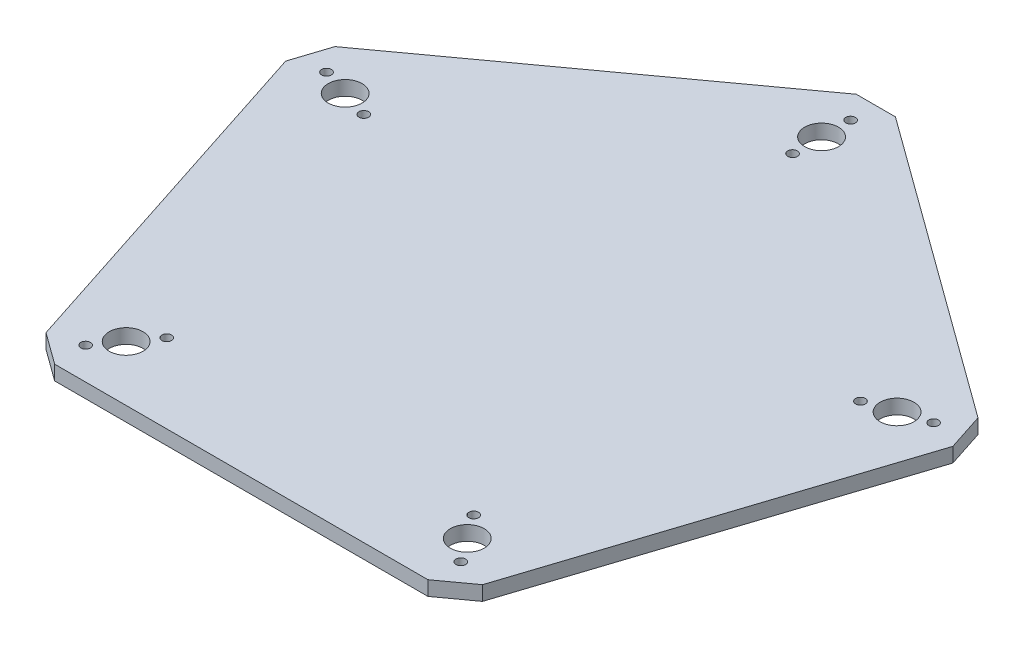
ISO-10303-21;
HEADER;
FILE_DESCRIPTION(('STEP AP214'),'2;1');
FILE_NAME('part.step','',(''),(''),'','','');
FILE_SCHEMA(('AUTOMOTIVE_DESIGN { 1 0 10303 214 1 1 1 1 }'));
ENDSEC;
DATA;
#1=APPLICATION_CONTEXT('core data for automotive mechanical design processes');
#2=APPLICATION_PROTOCOL_DEFINITION('international standard','automotive_design',2000,#1);
#3=PRODUCT_CONTEXT('',#1,'mechanical');
#4=PRODUCT('Part','Part','',(#3));
#5=PRODUCT_RELATED_PRODUCT_CATEGORY('part','',(#4));
#6=PRODUCT_DEFINITION_FORMATION('','',#4);
#7=PRODUCT_DEFINITION_CONTEXT('part definition',#1,'design');
#8=PRODUCT_DEFINITION('design','',#6,#7);
#9=PRODUCT_DEFINITION_SHAPE('','',#8);
#10=(LENGTH_UNIT() NAMED_UNIT(*) SI_UNIT(.MILLI.,.METRE.));
#11=(NAMED_UNIT(*) PLANE_ANGLE_UNIT() SI_UNIT($,.RADIAN.));
#12=(NAMED_UNIT(*) SI_UNIT($,.STERADIAN.) SOLID_ANGLE_UNIT());
#13=UNCERTAINTY_MEASURE_WITH_UNIT(LENGTH_MEASURE(1.E-05),#10,'distance_accuracy_value','');
#14=(GEOMETRIC_REPRESENTATION_CONTEXT(3) GLOBAL_UNCERTAINTY_ASSIGNED_CONTEXT((#13)) GLOBAL_UNIT_ASSIGNED_CONTEXT((#10,
#11,#12)) REPRESENTATION_CONTEXT('',''));
#15=CARTESIAN_POINT('',(0.,0.,0.));
#16=DIRECTION('',(0.,0.,1.));
#17=DIRECTION('',(1.,0.,0.));
#18=AXIS2_PLACEMENT_3D('',#15,#16,#17);
#19=CARTESIAN_POINT('',(0.,3.,0.));
#20=DIRECTION('',(0.,1.,0.));
#21=DIRECTION('',(0.,0.,1.));
#22=AXIS2_PLACEMENT_3D('',#19,#20,#21);
#23=PLANE('',#22);
#24=CARTESIAN_POINT('',(-38.7938266513032,3.,53.3951216287465));
#25=DIRECTION('',(0.,1.,0.));
#26=DIRECTION('',(0.,0.,1.));
#27=AXIS2_PLACEMENT_3D('',#24,#25,#26);
#28=CIRCLE('',#27,0.999999999999983);
#29=CARTESIAN_POINT('',(-38.7938266513032,3.,54.3951216287465));
#30=VERTEX_POINT('',#29);
#31=EDGE_CURVE('E275',#30,#30,#28,.T.);
#32=ORIENTED_EDGE('',*,*,#31,.F.);
#33=EDGE_LOOP('',(#32));
#34=FACE_BOUND('',#33,.T.);
#35=CARTESIAN_POINT('',(38.7938266513032,3.,53.3951216287465));
#36=DIRECTION('',(0.,1.,0.));
#37=DIRECTION('',(0.,0.,1.));
#38=AXIS2_PLACEMENT_3D('',#35,#36,#37);
#39=CIRCLE('',#38,0.999999999999998);
#40=CARTESIAN_POINT('',(38.7938266513032,3.,54.3951216287465));
#41=VERTEX_POINT('',#40);
#42=EDGE_CURVE('E263',#41,#41,#39,.T.);
#43=ORIENTED_EDGE('',*,*,#42,.F.);
#44=EDGE_LOOP('',(#43));
#45=FACE_BOUND('',#44,.T.);
#46=CARTESIAN_POINT('',(62.7697300754801,3.,-20.3951216287466));
#47=DIRECTION('',(0.,1.,0.));
#48=DIRECTION('',(0.,0.,1.));
#49=AXIS2_PLACEMENT_3D('',#46,#47,#48);
#50=CIRCLE('',#49,0.999999999999984);
#51=CARTESIAN_POINT('',(62.7697300754801,3.,-19.3951216287466));
#52=VERTEX_POINT('',#51);
#53=EDGE_CURVE('E251',#52,#52,#50,.T.);
#54=ORIENTED_EDGE('',*,*,#53,.F.);
#55=EDGE_LOOP('',(#54));
#56=FACE_BOUND('',#55,.T.);
#57=CARTESIAN_POINT('',(0.,3.,-66.));
#58=DIRECTION('',(0.,1.,0.));
#59=DIRECTION('',(0.,0.,1.));
#60=AXIS2_PLACEMENT_3D('',#57,#58,#59);
#61=CIRCLE('',#60,0.999999999999996);
#62=CARTESIAN_POINT('',(0.,3.,-65.));
#63=VERTEX_POINT('',#62);
#64=EDGE_CURVE('E239',#63,#63,#61,.T.);
#65=ORIENTED_EDGE('',*,*,#64,.F.);
#66=EDGE_LOOP('',(#65));
#67=FACE_BOUND('',#66,.T.);
#68=CARTESIAN_POINT('',(-35.2671151375483,3.,48.5410196624969));
#69=DIRECTION('',(0.,1.,0.));
#70=DIRECTION('',(0.,0.,1.));
#71=AXIS2_PLACEMENT_3D('',#68,#69,#70);
#72=CIRCLE('',#71,3.5);
#73=CARTESIAN_POINT('',(-35.2671151375483,3.,52.0410196624969));
#74=VERTEX_POINT('',#73);
#75=EDGE_CURVE('E227',#74,#74,#72,.T.);
#76=ORIENTED_EDGE('',*,*,#75,.F.);
#77=EDGE_LOOP('',(#76));
#78=FACE_BOUND('',#77,.T.);
#79=CARTESIAN_POINT('',(57.0633909777092,3.,-18.5410196624969));
#80=DIRECTION('',(0.,1.,0.));
#81=DIRECTION('',(0.,0.,1.));
#82=AXIS2_PLACEMENT_3D('',#79,#80,#81);
#83=CIRCLE('',#82,3.5);
#84=CARTESIAN_POINT('',(57.0633909777092,3.,-15.0410196624969));
#85=VERTEX_POINT('',#84);
#86=EDGE_CURVE('E215',#85,#85,#83,.T.);
#87=ORIENTED_EDGE('',*,*,#86,.F.);
#88=EDGE_LOOP('',(#87));
#89=FACE_BOUND('',#88,.T.);
#90=CARTESIAN_POINT('',(-62.7697300754801,3.,-20.3951216287465));
#91=DIRECTION('',(0.,1.,0.));
#92=DIRECTION('',(0.,0.,1.));
#93=AXIS2_PLACEMENT_3D('',#90,#91,#92);
#94=CIRCLE('',#93,0.999999999999998);
#95=CARTESIAN_POINT('',(-62.7697300754801,3.,-19.3951216287465));
#96=VERTEX_POINT('',#95);
#97=EDGE_CURVE('E203',#96,#96,#94,.T.);
#98=ORIENTED_EDGE('',*,*,#97,.F.);
#99=EDGE_LOOP('',(#98));
#100=FACE_BOUND('',#99,.T.);
#101=DIRECTION('',(0.309016994374948,0.,0.951056516295154));
#102=VECTOR('',#101,1.);
#103=CARTESIAN_POINT('',(-70.5342302750968,3.,-22.9179606750063));
#104=LINE('',#103,#102);
#105=CARTESIAN_POINT('',(-68.989145303222,3.,-18.1626780935305));
#106=VERTEX_POINT('',#105);
#107=CARTESIAN_POINT('',(-45.1376366521964,3.,55.2447174185242));
#108=VERTEX_POINT('',#107);
#109=EDGE_CURVE('E194',#106,#108,#104,.T.);
#110=ORIENTED_EDGE('',*,*,#109,.T.);
#111=DIRECTION('',(-0.809016994374947,0.,-0.587785252292474));
#112=VECTOR('',#111,1.);
#113=CARTESIAN_POINT('',(-41.8650941662591,3.,57.6223587092621));
#114=LINE('',#113,#112);
#115=CARTESIAN_POINT('',(-38.5925516803216,3.,60.));
#116=VERTEX_POINT('',#115);
#117=EDGE_CURVE('E165',#108,#116,#114,.F.);
#118=ORIENTED_EDGE('',*,*,#117,.T.);
#119=DIRECTION('',(1.,0.,0.));
#120=VECTOR('',#119,1.);
#121=CARTESIAN_POINT('',(-43.5925516803217,3.,60.));
#122=LINE('',#121,#120);
#123=CARTESIAN_POINT('',(38.5925516803215,3.,60.));
#124=VERTEX_POINT('',#123);
#125=EDGE_CURVE('E131',#116,#124,#122,.T.);
#126=ORIENTED_EDGE('',*,*,#125,.T.);
#127=DIRECTION('',(-0.809016994374948,0.,0.587785252292473));
#128=VECTOR('',#127,1.);
#129=CARTESIAN_POINT('',(41.865094166259,3.,57.6223587092621));
#130=LINE('',#129,#128);
#131=CARTESIAN_POINT('',(45.1376366521964,3.,55.2447174185242));
#132=VERTEX_POINT('',#131);
#133=EDGE_CURVE('E163',#124,#132,#130,.F.);
#134=ORIENTED_EDGE('',*,*,#133,.T.);
#135=DIRECTION('',(0.309016994374947,0.,-0.951056516295154));
#136=VECTOR('',#135,1.);
#137=CARTESIAN_POINT('',(43.5925516803216,3.,60.));
#138=LINE('',#137,#136);
#139=CARTESIAN_POINT('',(68.989145303222,3.,-18.1626780935305));
#140=VERTEX_POINT('',#139);
#141=EDGE_CURVE('E138',#132,#140,#138,.T.);
#142=ORIENTED_EDGE('',*,*,#141,.T.);
#143=DIRECTION('',(0.309016994374947,0.,0.951056516295154));
#144=VECTOR('',#143,1.);
#145=CARTESIAN_POINT('',(67.739145303222,3.,-22.0097825149995));
#146=LINE('',#145,#144);
#147=CARTESIAN_POINT('',(66.489145303222,3.,-25.8568869364687));
#148=VERTEX_POINT('',#147);
#149=EDGE_CURVE('E161',#140,#148,#146,.F.);
#150=ORIENTED_EDGE('',*,*,#149,.T.);
#151=DIRECTION('',(-0.809016994374947,0.,-0.587785252292473));
#152=VECTOR('',#151,1.);
#153=CARTESIAN_POINT('',(70.5342302750968,3.,-22.9179606750063));
#154=LINE('',#153,#152);
#155=CARTESIAN_POINT('',(4.04508497187477,3.,-71.225152388525));
#156=VERTEX_POINT('',#155);
#157=EDGE_CURVE('E142',#148,#156,#154,.T.);
#158=ORIENTED_EDGE('',*,*,#157,.T.);
#159=DIRECTION('',(1.,0.,0.));
#160=VECTOR('',#159,1.);
#161=CARTESIAN_POINT('',(1.22178836575723E-13,3.,-71.225152388525));
#162=LINE('',#161,#160);
#163=CARTESIAN_POINT('',(-4.04508497187471,3.,-71.225152388525));
#164=VERTEX_POINT('',#163);
#165=EDGE_CURVE('E54',#156,#164,#162,.F.);
#166=ORIENTED_EDGE('',*,*,#165,.T.);
#167=DIRECTION('',(-0.809016994374947,0.,0.587785252292473));
#168=VECTOR('',#167,1.);
#169=CARTESIAN_POINT('',(0.,3.,-74.1640786499874));
#170=LINE('',#169,#168);
#171=CARTESIAN_POINT('',(-66.489145303222,3.,-25.8568869364687));
#172=VERTEX_POINT('',#171);
#173=EDGE_CURVE('E197',#164,#172,#170,.T.);
#174=ORIENTED_EDGE('',*,*,#173,.T.);
#175=DIRECTION('',(0.309016994374948,0.,-0.951056516295154));
#176=VECTOR('',#175,1.);
#177=CARTESIAN_POINT('',(-67.739145303222,3.,-22.0097825149996));
#178=LINE('',#177,#176);
#179=EDGE_CURVE('E158',#172,#106,#178,.F.);
#180=ORIENTED_EDGE('',*,*,#179,.T.);
#181=EDGE_LOOP('',(#110,#118,#126,#134,#142,#150,#158,#166,#174,#180));
#182=FACE_BOUND('',#181,.T.);
#183=CARTESIAN_POINT('',(-57.0633909777092,3.,-18.5410196624968));
#184=DIRECTION('',(0.,1.,0.));
#185=DIRECTION('',(0.,0.,1.));
#186=AXIS2_PLACEMENT_3D('',#183,#184,#185);
#187=CIRCLE('',#186,3.5);
#188=CARTESIAN_POINT('',(-57.0633909777092,3.,-15.0410196624968));
#189=VERTEX_POINT('',#188);
#190=EDGE_CURVE('E190',#189,#189,#187,.T.);
#191=ORIENTED_EDGE('',*,*,#190,.F.);
#192=EDGE_LOOP('',(#191));
#193=FACE_BOUND('',#192,.T.);
#194=CARTESIAN_POINT('',(0.,3.,-60.));
#195=DIRECTION('',(0.,1.,0.));
#196=DIRECTION('',(0.,0.,1.));
#197=AXIS2_PLACEMENT_3D('',#194,#195,#196);
#198=CIRCLE('',#197,3.5);
#199=CARTESIAN_POINT('',(0.,3.,-56.5));
#200=VERTEX_POINT('',#199);
#201=EDGE_CURVE('E209',#200,#200,#198,.T.);
#202=ORIENTED_EDGE('',*,*,#201,.F.);
#203=EDGE_LOOP('',(#202));
#204=FACE_BOUND('',#203,.T.);
#205=CARTESIAN_POINT('',(35.2671151375484,3.,48.5410196624968));
#206=DIRECTION('',(0.,1.,0.));
#207=DIRECTION('',(0.,0.,1.));
#208=AXIS2_PLACEMENT_3D('',#205,#206,#207);
#209=CIRCLE('',#208,3.5);
#210=CARTESIAN_POINT('',(35.2671151375484,3.,52.0410196624968));
#211=VERTEX_POINT('',#210);
#212=EDGE_CURVE('E221',#211,#211,#209,.T.);
#213=ORIENTED_EDGE('',*,*,#212,.F.);
#214=EDGE_LOOP('',(#213));
#215=FACE_BOUND('',#214,.T.);
#216=CARTESIAN_POINT('',(-51.3570518799383,3.,-16.6869176962471));
#217=DIRECTION('',(0.,1.,0.));
#218=DIRECTION('',(0.,0.,-1.));
#219=AXIS2_PLACEMENT_3D('',#216,#217,#218);
#220=CIRCLE('',#219,0.999999999999998);
#221=CARTESIAN_POINT('',(-51.3570518799383,3.,-17.6869176962471));
#222=VERTEX_POINT('',#221);
#223=EDGE_CURVE('E233',#222,#222,#220,.T.);
#224=ORIENTED_EDGE('',*,*,#223,.F.);
#225=EDGE_LOOP('',(#224));
#226=FACE_BOUND('',#225,.T.);
#227=CARTESIAN_POINT('',(0.,3.,-54.));
#228=DIRECTION('',(0.,1.,0.));
#229=DIRECTION('',(0.,0.,-1.));
#230=AXIS2_PLACEMENT_3D('',#227,#228,#229);
#231=CIRCLE('',#230,1.);
#232=CARTESIAN_POINT('',(0.,3.,-55.));
#233=VERTEX_POINT('',#232);
#234=EDGE_CURVE('E245',#233,#233,#231,.T.);
#235=ORIENTED_EDGE('',*,*,#234,.F.);
#236=EDGE_LOOP('',(#235));
#237=FACE_BOUND('',#236,.T.);
#238=CARTESIAN_POINT('',(51.3570518799382,3.,-16.6869176962472));
#239=DIRECTION('',(0.,1.,0.));
#240=DIRECTION('',(0.,0.,-1.));
#241=AXIS2_PLACEMENT_3D('',#238,#239,#240);
#242=CIRCLE('',#241,0.999999999999998);
#243=CARTESIAN_POINT('',(51.3570518799382,3.,-17.6869176962472));
#244=VERTEX_POINT('',#243);
#245=EDGE_CURVE('E257',#244,#244,#242,.T.);
#246=ORIENTED_EDGE('',*,*,#245,.F.);
#247=EDGE_LOOP('',(#246));
#248=FACE_BOUND('',#247,.T.);
#249=CARTESIAN_POINT('',(31.7404036237935,3.,43.6869176962471));
#250=DIRECTION('',(0.,1.,0.));
#251=DIRECTION('',(0.,0.,-1.));
#252=AXIS2_PLACEMENT_3D('',#249,#250,#251);
#253=CIRCLE('',#252,0.999999999999998);
#254=CARTESIAN_POINT('',(31.7404036237935,3.,42.6869176962471));
#255=VERTEX_POINT('',#254);
#256=EDGE_CURVE('E269',#255,#255,#253,.T.);
#257=ORIENTED_EDGE('',*,*,#256,.F.);
#258=EDGE_LOOP('',(#257));
#259=FACE_BOUND('',#258,.T.);
#260=CARTESIAN_POINT('',(-31.7404036237935,3.,43.6869176962471));
#261=DIRECTION('',(0.,1.,0.));
#262=DIRECTION('',(0.,0.,-1.));
#263=AXIS2_PLACEMENT_3D('',#260,#261,#262);
#264=CIRCLE('',#263,0.999999999999998);
#265=CARTESIAN_POINT('',(-31.7404036237935,3.,42.6869176962471));
#266=VERTEX_POINT('',#265);
#267=EDGE_CURVE('E281',#266,#266,#264,.T.);
#268=ORIENTED_EDGE('',*,*,#267,.F.);
#269=EDGE_LOOP('',(#268));
#270=FACE_BOUND('',#269,.T.);
#271=ADVANCED_FACE('F33',(#34,#45,#56,#67,#78,#89,#100,#182,#193,#204,#215,#226,#237,#248,#259,
#270),#23,.T.);
#272=CARTESIAN_POINT('',(0.,0.,0.));
#273=DIRECTION('',(0.,1.,0.));
#274=DIRECTION('',(0.,0.,1.));
#275=AXIS2_PLACEMENT_3D('',#272,#273,#274);
#276=PLANE('',#275);
#277=CARTESIAN_POINT('',(-38.7938266513032,0.,53.3951216287465));
#278=DIRECTION('',(0.,1.,0.));
#279=DIRECTION('',(0.,0.,1.));
#280=AXIS2_PLACEMENT_3D('',#277,#278,#279);
#281=CIRCLE('',#280,0.999999999999983);
#282=CARTESIAN_POINT('',(-38.7938266513032,0.,54.3951216287465));
#283=VERTEX_POINT('',#282);
#284=EDGE_CURVE('E278',#283,#283,#281,.T.);
#285=ORIENTED_EDGE('',*,*,#284,.T.);
#286=EDGE_LOOP('',(#285));
#287=FACE_BOUND('',#286,.T.);
#288=CARTESIAN_POINT('',(38.7938266513032,0.,53.3951216287465));
#289=DIRECTION('',(0.,1.,0.));
#290=DIRECTION('',(0.,0.,1.));
#291=AXIS2_PLACEMENT_3D('',#288,#289,#290);
#292=CIRCLE('',#291,0.999999999999998);
#293=CARTESIAN_POINT('',(38.7938266513032,0.,54.3951216287465));
#294=VERTEX_POINT('',#293);
#295=EDGE_CURVE('E266',#294,#294,#292,.T.);
#296=ORIENTED_EDGE('',*,*,#295,.T.);
#297=EDGE_LOOP('',(#296));
#298=FACE_BOUND('',#297,.T.);
#299=CARTESIAN_POINT('',(62.7697300754801,0.,-20.3951216287466));
#300=DIRECTION('',(0.,1.,0.));
#301=DIRECTION('',(0.,0.,1.));
#302=AXIS2_PLACEMENT_3D('',#299,#300,#301);
#303=CIRCLE('',#302,0.999999999999984);
#304=CARTESIAN_POINT('',(62.7697300754801,0.,-19.3951216287466));
#305=VERTEX_POINT('',#304);
#306=EDGE_CURVE('E254',#305,#305,#303,.T.);
#307=ORIENTED_EDGE('',*,*,#306,.T.);
#308=EDGE_LOOP('',(#307));
#309=FACE_BOUND('',#308,.T.);
#310=CARTESIAN_POINT('',(0.,0.,-66.));
#311=DIRECTION('',(0.,1.,0.));
#312=DIRECTION('',(0.,0.,1.));
#313=AXIS2_PLACEMENT_3D('',#310,#311,#312);
#314=CIRCLE('',#313,0.999999999999996);
#315=CARTESIAN_POINT('',(0.,0.,-65.));
#316=VERTEX_POINT('',#315);
#317=EDGE_CURVE('E242',#316,#316,#314,.T.);
#318=ORIENTED_EDGE('',*,*,#317,.T.);
#319=EDGE_LOOP('',(#318));
#320=FACE_BOUND('',#319,.T.);
#321=CARTESIAN_POINT('',(-35.2671151375483,0.,48.5410196624969));
#322=DIRECTION('',(0.,1.,0.));
#323=DIRECTION('',(0.,0.,1.));
#324=AXIS2_PLACEMENT_3D('',#321,#322,#323);
#325=CIRCLE('',#324,3.5);
#326=CARTESIAN_POINT('',(-35.2671151375483,0.,52.0410196624969));
#327=VERTEX_POINT('',#326);
#328=EDGE_CURVE('E230',#327,#327,#325,.T.);
#329=ORIENTED_EDGE('',*,*,#328,.T.);
#330=EDGE_LOOP('',(#329));
#331=FACE_BOUND('',#330,.T.);
#332=CARTESIAN_POINT('',(57.0633909777092,0.,-18.5410196624969));
#333=DIRECTION('',(0.,1.,0.));
#334=DIRECTION('',(0.,0.,1.));
#335=AXIS2_PLACEMENT_3D('',#332,#333,#334);
#336=CIRCLE('',#335,3.5);
#337=CARTESIAN_POINT('',(57.0633909777092,0.,-15.0410196624969));
#338=VERTEX_POINT('',#337);
#339=EDGE_CURVE('E218',#338,#338,#336,.T.);
#340=ORIENTED_EDGE('',*,*,#339,.T.);
#341=EDGE_LOOP('',(#340));
#342=FACE_BOUND('',#341,.T.);
#343=CARTESIAN_POINT('',(-62.7697300754801,0.,-20.3951216287465));
#344=DIRECTION('',(0.,1.,0.));
#345=DIRECTION('',(0.,0.,1.));
#346=AXIS2_PLACEMENT_3D('',#343,#344,#345);
#347=CIRCLE('',#346,0.999999999999998);
#348=CARTESIAN_POINT('',(-62.7697300754801,0.,-19.3951216287465));
#349=VERTEX_POINT('',#348);
#350=EDGE_CURVE('E206',#349,#349,#347,.T.);
#351=ORIENTED_EDGE('',*,*,#350,.T.);
#352=EDGE_LOOP('',(#351));
#353=FACE_BOUND('',#352,.T.);
#354=DIRECTION('',(1.,0.,0.));
#355=VECTOR('',#354,1.);
#356=CARTESIAN_POINT('',(-43.5925516803217,0.,60.));
#357=LINE('',#356,#355);
#358=CARTESIAN_POINT('',(-38.5925516803216,0.,60.));
#359=VERTEX_POINT('',#358);
#360=CARTESIAN_POINT('',(38.5925516803216,0.,60.));
#361=VERTEX_POINT('',#360);
#362=EDGE_CURVE('E128',#359,#361,#357,.T.);
#363=ORIENTED_EDGE('',*,*,#362,.F.);
#364=DIRECTION('',(0.809016994374947,0.,0.587785252292474));
#365=VECTOR('',#364,1.);
#366=CARTESIAN_POINT('',(-38.5925516803216,0.,60.));
#367=LINE('',#366,#365);
#368=CARTESIAN_POINT('',(-45.1376366521964,0.,55.2447174185242));
#369=VERTEX_POINT('',#368);
#370=EDGE_CURVE('E111',#359,#369,#367,.F.);
#371=ORIENTED_EDGE('',*,*,#370,.T.);
#372=DIRECTION('',(0.309016994374948,0.,0.951056516295154));
#373=VECTOR('',#372,1.);
#374=CARTESIAN_POINT('',(-70.5342302750968,0.,-22.9179606750063));
#375=LINE('',#374,#373);
#376=CARTESIAN_POINT('',(-68.989145303222,0.,-18.1626780935305));
#377=VERTEX_POINT('',#376);
#378=EDGE_CURVE('E139',#377,#369,#375,.T.);
#379=ORIENTED_EDGE('',*,*,#378,.F.);
#380=DIRECTION('',(-0.309016994374948,0.,0.951056516295154));
#381=VECTOR('',#380,1.);
#382=CARTESIAN_POINT('',(-68.989145303222,0.,-18.1626780935305));
#383=LINE('',#382,#381);
#384=CARTESIAN_POINT('',(-66.489145303222,0.,-25.8568869364687));
#385=VERTEX_POINT('',#384);
#386=EDGE_CURVE('E132',#377,#385,#383,.F.);
#387=ORIENTED_EDGE('',*,*,#386,.T.);
#388=DIRECTION('',(-0.809016994374947,0.,0.587785252292473));
#389=VECTOR('',#388,1.);
#390=CARTESIAN_POINT('',(0.,0.,-74.1640786499874));
#391=LINE('',#390,#389);
#392=CARTESIAN_POINT('',(-4.04508497187472,0.,-71.225152388525));
#393=VERTEX_POINT('',#392);
#394=EDGE_CURVE('E144',#393,#385,#391,.T.);
#395=ORIENTED_EDGE('',*,*,#394,.F.);
#396=DIRECTION('',(-1.,0.,0.));
#397=VECTOR('',#396,1.);
#398=CARTESIAN_POINT('',(-4.04508497187473,0.,-71.225152388525));
#399=LINE('',#398,#397);
#400=CARTESIAN_POINT('',(4.04508497187478,0.,-71.225152388525));
#401=VERTEX_POINT('',#400);
#402=EDGE_CURVE('E150',#393,#401,#399,.F.);
#403=ORIENTED_EDGE('',*,*,#402,.T.);
#404=DIRECTION('',(-0.809016994374947,0.,-0.587785252292473));
#405=VECTOR('',#404,1.);
#406=CARTESIAN_POINT('',(70.5342302750968,0.,-22.9179606750063));
#407=LINE('',#406,#405);
#408=CARTESIAN_POINT('',(66.489145303222,0.,-25.8568869364687));
#409=VERTEX_POINT('',#408);
#410=EDGE_CURVE('E182',#409,#401,#407,.T.);
#411=ORIENTED_EDGE('',*,*,#410,.F.);
#412=DIRECTION('',(-0.309016994374947,0.,-0.951056516295154));
#413=VECTOR('',#412,1.);
#414=CARTESIAN_POINT('',(66.489145303222,0.,-25.8568869364687));
#415=LINE('',#414,#413);
#416=CARTESIAN_POINT('',(68.989145303222,0.,-18.1626780935305));
#417=VERTEX_POINT('',#416);
#418=EDGE_CURVE('E152',#409,#417,#415,.F.);
#419=ORIENTED_EDGE('',*,*,#418,.T.);
#420=DIRECTION('',(0.309016994374947,0.,-0.951056516295154));
#421=VECTOR('',#420,1.);
#422=CARTESIAN_POINT('',(43.5925516803216,0.,60.));
#423=LINE('',#422,#421);
#424=CARTESIAN_POINT('',(45.1376366521964,0.,55.2447174185242));
#425=VERTEX_POINT('',#424);
#426=EDGE_CURVE('E188',#425,#417,#423,.T.);
#427=ORIENTED_EDGE('',*,*,#426,.F.);
#428=DIRECTION('',(0.809016994374948,0.,-0.587785252292473));
#429=VECTOR('',#428,1.);
#430=CARTESIAN_POINT('',(45.1376366521964,0.,55.2447174185242));
#431=LINE('',#430,#429);
#432=EDGE_CURVE('E122',#425,#361,#431,.F.);
#433=ORIENTED_EDGE('',*,*,#432,.T.);
#434=EDGE_LOOP('',(#363,#371,#379,#387,#395,#403,#411,#419,#427,#433));
#435=FACE_BOUND('',#434,.T.);
#436=CARTESIAN_POINT('',(-57.0633909777092,0.,-18.5410196624968));
#437=DIRECTION('',(0.,1.,0.));
#438=DIRECTION('',(0.,0.,1.));
#439=AXIS2_PLACEMENT_3D('',#436,#437,#438);
#440=CIRCLE('',#439,3.5);
#441=CARTESIAN_POINT('',(-57.0633909777092,0.,-15.0410196624968));
#442=VERTEX_POINT('',#441);
#443=EDGE_CURVE('E200',#442,#442,#440,.T.);
#444=ORIENTED_EDGE('',*,*,#443,.T.);
#445=EDGE_LOOP('',(#444));
#446=FACE_BOUND('',#445,.T.);
#447=CARTESIAN_POINT('',(0.,0.,-60.));
#448=DIRECTION('',(0.,1.,0.));
#449=DIRECTION('',(0.,0.,1.));
#450=AXIS2_PLACEMENT_3D('',#447,#448,#449);
#451=CIRCLE('',#450,3.5);
#452=CARTESIAN_POINT('',(0.,0.,-56.5));
#453=VERTEX_POINT('',#452);
#454=EDGE_CURVE('E212',#453,#453,#451,.T.);
#455=ORIENTED_EDGE('',*,*,#454,.T.);
#456=EDGE_LOOP('',(#455));
#457=FACE_BOUND('',#456,.T.);
#458=CARTESIAN_POINT('',(35.2671151375484,0.,48.5410196624968));
#459=DIRECTION('',(0.,1.,0.));
#460=DIRECTION('',(0.,0.,1.));
#461=AXIS2_PLACEMENT_3D('',#458,#459,#460);
#462=CIRCLE('',#461,3.5);
#463=CARTESIAN_POINT('',(35.2671151375484,0.,52.0410196624968));
#464=VERTEX_POINT('',#463);
#465=EDGE_CURVE('E224',#464,#464,#462,.T.);
#466=ORIENTED_EDGE('',*,*,#465,.T.);
#467=EDGE_LOOP('',(#466));
#468=FACE_BOUND('',#467,.T.);
#469=CARTESIAN_POINT('',(-51.3570518799383,0.,-16.6869176962471));
#470=DIRECTION('',(0.,1.,0.));
#471=DIRECTION('',(0.,0.,-1.));
#472=AXIS2_PLACEMENT_3D('',#469,#470,#471);
#473=CIRCLE('',#472,0.999999999999998);
#474=CARTESIAN_POINT('',(-51.3570518799383,0.,-17.6869176962471));
#475=VERTEX_POINT('',#474);
#476=EDGE_CURVE('E236',#475,#475,#473,.T.);
#477=ORIENTED_EDGE('',*,*,#476,.T.);
#478=EDGE_LOOP('',(#477));
#479=FACE_BOUND('',#478,.T.);
#480=CARTESIAN_POINT('',(0.,0.,-54.));
#481=DIRECTION('',(0.,1.,0.));
#482=DIRECTION('',(0.,0.,-1.));
#483=AXIS2_PLACEMENT_3D('',#480,#481,#482);
#484=CIRCLE('',#483,1.);
#485=CARTESIAN_POINT('',(0.,0.,-55.));
#486=VERTEX_POINT('',#485);
#487=EDGE_CURVE('E248',#486,#486,#484,.T.);
#488=ORIENTED_EDGE('',*,*,#487,.T.);
#489=EDGE_LOOP('',(#488));
#490=FACE_BOUND('',#489,.T.);
#491=CARTESIAN_POINT('',(51.3570518799382,0.,-16.6869176962472));
#492=DIRECTION('',(0.,1.,0.));
#493=DIRECTION('',(0.,0.,-1.));
#494=AXIS2_PLACEMENT_3D('',#491,#492,#493);
#495=CIRCLE('',#494,0.999999999999998);
#496=CARTESIAN_POINT('',(51.3570518799382,0.,-17.6869176962472));
#497=VERTEX_POINT('',#496);
#498=EDGE_CURVE('E260',#497,#497,#495,.T.);
#499=ORIENTED_EDGE('',*,*,#498,.T.);
#500=EDGE_LOOP('',(#499));
#501=FACE_BOUND('',#500,.T.);
#502=CARTESIAN_POINT('',(31.7404036237935,0.,43.6869176962471));
#503=DIRECTION('',(0.,1.,0.));
#504=DIRECTION('',(0.,0.,-1.));
#505=AXIS2_PLACEMENT_3D('',#502,#503,#504);
#506=CIRCLE('',#505,0.999999999999998);
#507=CARTESIAN_POINT('',(31.7404036237935,0.,42.6869176962471));
#508=VERTEX_POINT('',#507);
#509=EDGE_CURVE('E272',#508,#508,#506,.T.);
#510=ORIENTED_EDGE('',*,*,#509,.T.);
#511=EDGE_LOOP('',(#510));
#512=FACE_BOUND('',#511,.T.);
#513=CARTESIAN_POINT('',(-31.7404036237935,0.,43.6869176962471));
#514=DIRECTION('',(0.,1.,0.));
#515=DIRECTION('',(0.,0.,-1.));
#516=AXIS2_PLACEMENT_3D('',#513,#514,#515);
#517=CIRCLE('',#516,0.999999999999998);
#518=CARTESIAN_POINT('',(-31.7404036237935,0.,42.6869176962471));
#519=VERTEX_POINT('',#518);
#520=EDGE_CURVE('E284',#519,#519,#517,.T.);
#521=ORIENTED_EDGE('',*,*,#520,.T.);
#522=EDGE_LOOP('',(#521));
#523=FACE_BOUND('',#522,.T.);
#524=ADVANCED_FACE('F135',(#287,#298,#309,#320,#331,#342,#353,#435,#446,#457,#468,#479,#490,
#501,#512,#523),#276,.F.);
#525=CARTESIAN_POINT('',(43.5925516803216,3.,60.));
#526=DIRECTION('',(-0.951056516295154,0.,-0.309016994374947));
#527=DIRECTION('',(-0.309016994374947,0.,0.951056516295154));
#528=AXIS2_PLACEMENT_3D('',#525,#526,#527);
#529=PLANE('',#528);
#530=ORIENTED_EDGE('',*,*,#141,.F.);
#531=DIRECTION('',(0.,-1.,0.));
#532=VECTOR('',#531,1.);
#533=CARTESIAN_POINT('',(45.1376366521964,3.,55.2447174185242));
#534=LINE('',#533,#532);
#535=EDGE_CURVE('E169',#132,#425,#534,.T.);
#536=ORIENTED_EDGE('',*,*,#535,.T.);
#537=ORIENTED_EDGE('',*,*,#426,.T.);
#538=DIRECTION('',(0.,1.,0.));
#539=VECTOR('',#538,1.);
#540=CARTESIAN_POINT('',(68.989145303222,3.,-18.1626780935305));
#541=LINE('',#540,#539);
#542=EDGE_CURVE('E167',#417,#140,#541,.T.);
#543=ORIENTED_EDGE('',*,*,#542,.T.);
#544=EDGE_LOOP('',(#530,#536,#537,#543));
#545=FACE_BOUND('',#544,.T.);
#546=ADVANCED_FACE('F300',(#545),#529,.F.);
#547=CARTESIAN_POINT('',(70.5342302750968,3.,-22.9179606750063));
#548=DIRECTION('',(-0.587785252292473,0.,0.809016994374947));
#549=DIRECTION('',(0.809016994374947,0.,0.587785252292473));
#550=AXIS2_PLACEMENT_3D('',#547,#548,#549);
#551=PLANE('',#550);
#552=ORIENTED_EDGE('',*,*,#157,.F.);
#553=DIRECTION('',(0.,-1.,0.));
#554=VECTOR('',#553,1.);
#555=CARTESIAN_POINT('',(66.489145303222,3.,-25.8568869364687));
#556=LINE('',#555,#554);
#557=EDGE_CURVE('E174',#148,#409,#556,.T.);
#558=ORIENTED_EDGE('',*,*,#557,.T.);
#559=ORIENTED_EDGE('',*,*,#410,.T.);
#560=DIRECTION('',(0.,1.,0.));
#561=VECTOR('',#560,1.);
#562=CARTESIAN_POINT('',(4.04508497187478,3.,-71.225152388525));
#563=LINE('',#562,#561);
#564=EDGE_CURVE('E172',#401,#156,#563,.T.);
#565=ORIENTED_EDGE('',*,*,#564,.T.);
#566=EDGE_LOOP('',(#552,#558,#559,#565));
#567=FACE_BOUND('',#566,.T.);
#568=ADVANCED_FACE('F181',(#567),#551,.F.);
#569=CARTESIAN_POINT('',(0.,3.,-74.1640786499874));
#570=DIRECTION('',(0.587785252292473,0.,0.809016994374947));
#571=DIRECTION('',(0.809016994374948,0.,-0.587785252292473));
#572=AXIS2_PLACEMENT_3D('',#569,#570,#571);
#573=PLANE('',#572);
#574=ORIENTED_EDGE('',*,*,#173,.F.);
#575=DIRECTION('',(0.,-1.,0.));
#576=VECTOR('',#575,1.);
#577=CARTESIAN_POINT('',(-4.04508497187472,3.,-71.225152388525));
#578=LINE('',#577,#576);
#579=EDGE_CURVE('E11',#164,#393,#578,.T.);
#580=ORIENTED_EDGE('',*,*,#579,.T.);
#581=ORIENTED_EDGE('',*,*,#394,.T.);
#582=DIRECTION('',(0.,1.,0.));
#583=VECTOR('',#582,1.);
#584=CARTESIAN_POINT('',(-66.489145303222,3.,-25.8568869364687));
#585=LINE('',#584,#583);
#586=EDGE_CURVE('E41',#385,#172,#585,.T.);
#587=ORIENTED_EDGE('',*,*,#586,.T.);
#588=EDGE_LOOP('',(#574,#580,#581,#587));
#589=FACE_BOUND('',#588,.T.);
#590=ADVANCED_FACE('F314',(#589),#573,.F.);
#591=CARTESIAN_POINT('',(-70.5342302750968,3.,-22.9179606750063));
#592=DIRECTION('',(0.951056516295153,0.,-0.309016994374947));
#593=DIRECTION('',(-0.309016994374948,0.,-0.951056516295154));
#594=AXIS2_PLACEMENT_3D('',#591,#592,#593);
#595=PLANE('',#594);
#596=ORIENTED_EDGE('',*,*,#378,.T.);
#597=DIRECTION('',(0.,1.,0.));
#598=VECTOR('',#597,1.);
#599=CARTESIAN_POINT('',(-45.1376366521964,3.,55.2447174185242));
#600=LINE('',#599,#598);
#601=EDGE_CURVE('E116',#369,#108,#600,.T.);
#602=ORIENTED_EDGE('',*,*,#601,.T.);
#603=ORIENTED_EDGE('',*,*,#109,.F.);
#604=DIRECTION('',(0.,-1.,0.));
#605=VECTOR('',#604,1.);
#606=CARTESIAN_POINT('',(-68.989145303222,3.,-18.1626780935305));
#607=LINE('',#606,#605);
#608=EDGE_CURVE('E121',#106,#377,#607,.T.);
#609=ORIENTED_EDGE('',*,*,#608,.T.);
#610=EDGE_LOOP('',(#596,#602,#603,#609));
#611=FACE_BOUND('',#610,.T.);
#612=ADVANCED_FACE('F311',(#611),#595,.F.);
#613=CARTESIAN_POINT('',(-43.5925516803217,3.,60.));
#614=DIRECTION('',(0.,0.,-1.));
#615=DIRECTION('',(-1.,0.,0.));
#616=AXIS2_PLACEMENT_3D('',#613,#614,#615);
#617=PLANE('',#616);
#618=ORIENTED_EDGE('',*,*,#125,.F.);
#619=DIRECTION('',(0.,-1.,0.));
#620=VECTOR('',#619,1.);
#621=CARTESIAN_POINT('',(-38.5925516803216,3.,60.));
#622=LINE('',#621,#620);
#623=EDGE_CURVE('E115',#116,#359,#622,.T.);
#624=ORIENTED_EDGE('',*,*,#623,.T.);
#625=ORIENTED_EDGE('',*,*,#362,.T.);
#626=DIRECTION('',(0.,1.,0.));
#627=VECTOR('',#626,1.);
#628=CARTESIAN_POINT('',(38.5925516803216,3.,60.));
#629=LINE('',#628,#627);
#630=EDGE_CURVE('E133',#361,#124,#629,.T.);
#631=ORIENTED_EDGE('',*,*,#630,.T.);
#632=EDGE_LOOP('',(#618,#624,#625,#631));
#633=FACE_BOUND('',#632,.T.);
#634=ADVANCED_FACE('F127',(#633),#617,.F.);
#635=CARTESIAN_POINT('',(-57.0633909777092,3.,-18.5410196624968));
#636=DIRECTION('',(0.,-1.,0.));
#637=DIRECTION('',(0.,0.,-1.));
#638=AXIS2_PLACEMENT_3D('',#635,#636,#637);
#639=CYLINDRICAL_SURFACE('',#638,3.5);
#640=ORIENTED_EDGE('',*,*,#190,.T.);
#641=EDGE_LOOP('',(#640));
#642=FACE_BOUND('',#641,.T.);
#643=ORIENTED_EDGE('',*,*,#443,.F.);
#644=EDGE_LOOP('',(#643));
#645=FACE_BOUND('',#644,.T.);
#646=ADVANCED_FACE('F306',(#642,#645),#639,.F.);
#647=CARTESIAN_POINT('',(-62.7697300754801,3.,-20.3951216287465));
#648=DIRECTION('',(0.,-1.,0.));
#649=DIRECTION('',(0.,0.,-1.));
#650=AXIS2_PLACEMENT_3D('',#647,#648,#649);
#651=CYLINDRICAL_SURFACE('',#650,0.999999999999998);
#652=ORIENTED_EDGE('',*,*,#97,.T.);
#653=EDGE_LOOP('',(#652));
#654=FACE_BOUND('',#653,.T.);
#655=ORIENTED_EDGE('',*,*,#350,.F.);
#656=EDGE_LOOP('',(#655));
#657=FACE_BOUND('',#656,.T.);
#658=ADVANCED_FACE('F415',(#654,#657),#651,.F.);
#659=CARTESIAN_POINT('',(0.,3.,-60.));
#660=DIRECTION('',(0.,-1.,0.));
#661=DIRECTION('',(0.,0.,-1.));
#662=AXIS2_PLACEMENT_3D('',#659,#660,#661);
#663=CYLINDRICAL_SURFACE('',#662,3.5);
#664=ORIENTED_EDGE('',*,*,#201,.T.);
#665=EDGE_LOOP('',(#664));
#666=FACE_BOUND('',#665,.T.);
#667=ORIENTED_EDGE('',*,*,#454,.F.);
#668=EDGE_LOOP('',(#667));
#669=FACE_BOUND('',#668,.T.);
#670=ADVANCED_FACE('F412',(#666,#669),#663,.F.);
#671=CARTESIAN_POINT('',(57.0633909777092,3.,-18.5410196624969));
#672=DIRECTION('',(0.,-1.,0.));
#673=DIRECTION('',(0.,0.,-1.));
#674=AXIS2_PLACEMENT_3D('',#671,#672,#673);
#675=CYLINDRICAL_SURFACE('',#674,3.5);
#676=ORIENTED_EDGE('',*,*,#86,.T.);
#677=EDGE_LOOP('',(#676));
#678=FACE_BOUND('',#677,.T.);
#679=ORIENTED_EDGE('',*,*,#339,.F.);
#680=EDGE_LOOP('',(#679));
#681=FACE_BOUND('',#680,.T.);
#682=ADVANCED_FACE('F408',(#678,#681),#675,.F.);
#683=CARTESIAN_POINT('',(35.2671151375484,3.,48.5410196624968));
#684=DIRECTION('',(0.,-1.,0.));
#685=DIRECTION('',(0.,0.,-1.));
#686=AXIS2_PLACEMENT_3D('',#683,#684,#685);
#687=CYLINDRICAL_SURFACE('',#686,3.5);
#688=ORIENTED_EDGE('',*,*,#212,.T.);
#689=EDGE_LOOP('',(#688));
#690=FACE_BOUND('',#689,.T.);
#691=ORIENTED_EDGE('',*,*,#465,.F.);
#692=EDGE_LOOP('',(#691));
#693=FACE_BOUND('',#692,.T.);
#694=ADVANCED_FACE('F404',(#690,#693),#687,.F.);
#695=CARTESIAN_POINT('',(-35.2671151375483,3.,48.5410196624969));
#696=DIRECTION('',(0.,-1.,0.));
#697=DIRECTION('',(0.,0.,-1.));
#698=AXIS2_PLACEMENT_3D('',#695,#696,#697);
#699=CYLINDRICAL_SURFACE('',#698,3.5);
#700=ORIENTED_EDGE('',*,*,#75,.T.);
#701=EDGE_LOOP('',(#700));
#702=FACE_BOUND('',#701,.T.);
#703=ORIENTED_EDGE('',*,*,#328,.F.);
#704=EDGE_LOOP('',(#703));
#705=FACE_BOUND('',#704,.T.);
#706=ADVANCED_FACE('F400',(#702,#705),#699,.F.);
#707=CARTESIAN_POINT('',(-51.3570518799383,3.,-16.6869176962471));
#708=DIRECTION('',(0.,-1.,0.));
#709=DIRECTION('',(0.,0.,-1.));
#710=AXIS2_PLACEMENT_3D('',#707,#708,#709);
#711=CYLINDRICAL_SURFACE('',#710,0.999999999999998);
#712=ORIENTED_EDGE('',*,*,#223,.T.);
#713=EDGE_LOOP('',(#712));
#714=FACE_BOUND('',#713,.T.);
#715=ORIENTED_EDGE('',*,*,#476,.F.);
#716=EDGE_LOOP('',(#715));
#717=FACE_BOUND('',#716,.T.);
#718=ADVANCED_FACE('F396',(#714,#717),#711,.F.);
#719=CARTESIAN_POINT('',(0.,3.,-66.));
#720=DIRECTION('',(0.,-1.,0.));
#721=DIRECTION('',(0.,0.,-1.));
#722=AXIS2_PLACEMENT_3D('',#719,#720,#721);
#723=CYLINDRICAL_SURFACE('',#722,0.999999999999996);
#724=ORIENTED_EDGE('',*,*,#64,.T.);
#725=EDGE_LOOP('',(#724));
#726=FACE_BOUND('',#725,.T.);
#727=ORIENTED_EDGE('',*,*,#317,.F.);
#728=EDGE_LOOP('',(#727));
#729=FACE_BOUND('',#728,.T.);
#730=ADVANCED_FACE('F392',(#726,#729),#723,.F.);
#731=CARTESIAN_POINT('',(0.,3.,-54.));
#732=DIRECTION('',(0.,-1.,0.));
#733=DIRECTION('',(0.,0.,-1.));
#734=AXIS2_PLACEMENT_3D('',#731,#732,#733);
#735=CYLINDRICAL_SURFACE('',#734,1.);
#736=ORIENTED_EDGE('',*,*,#234,.T.);
#737=EDGE_LOOP('',(#736));
#738=FACE_BOUND('',#737,.T.);
#739=ORIENTED_EDGE('',*,*,#487,.F.);
#740=EDGE_LOOP('',(#739));
#741=FACE_BOUND('',#740,.T.);
#742=ADVANCED_FACE('F388',(#738,#741),#735,.F.);
#743=CARTESIAN_POINT('',(62.7697300754801,3.,-20.3951216287466));
#744=DIRECTION('',(0.,-1.,0.));
#745=DIRECTION('',(0.,0.,-1.));
#746=AXIS2_PLACEMENT_3D('',#743,#744,#745);
#747=CYLINDRICAL_SURFACE('',#746,0.999999999999984);
#748=ORIENTED_EDGE('',*,*,#53,.T.);
#749=EDGE_LOOP('',(#748));
#750=FACE_BOUND('',#749,.T.);
#751=ORIENTED_EDGE('',*,*,#306,.F.);
#752=EDGE_LOOP('',(#751));
#753=FACE_BOUND('',#752,.T.);
#754=ADVANCED_FACE('F384',(#750,#753),#747,.F.);
#755=CARTESIAN_POINT('',(51.3570518799382,3.,-16.6869176962472));
#756=DIRECTION('',(0.,-1.,0.));
#757=DIRECTION('',(0.,0.,-1.));
#758=AXIS2_PLACEMENT_3D('',#755,#756,#757);
#759=CYLINDRICAL_SURFACE('',#758,0.999999999999998);
#760=ORIENTED_EDGE('',*,*,#245,.T.);
#761=EDGE_LOOP('',(#760));
#762=FACE_BOUND('',#761,.T.);
#763=ORIENTED_EDGE('',*,*,#498,.F.);
#764=EDGE_LOOP('',(#763));
#765=FACE_BOUND('',#764,.T.);
#766=ADVANCED_FACE('F380',(#762,#765),#759,.F.);
#767=CARTESIAN_POINT('',(38.7938266513032,3.,53.3951216287465));
#768=DIRECTION('',(0.,-1.,0.));
#769=DIRECTION('',(0.,0.,-1.));
#770=AXIS2_PLACEMENT_3D('',#767,#768,#769);
#771=CYLINDRICAL_SURFACE('',#770,0.999999999999998);
#772=ORIENTED_EDGE('',*,*,#42,.T.);
#773=EDGE_LOOP('',(#772));
#774=FACE_BOUND('',#773,.T.);
#775=ORIENTED_EDGE('',*,*,#295,.F.);
#776=EDGE_LOOP('',(#775));
#777=FACE_BOUND('',#776,.T.);
#778=ADVANCED_FACE('F365',(#774,#777),#771,.F.);
#779=CARTESIAN_POINT('',(31.7404036237935,3.,43.6869176962471));
#780=DIRECTION('',(0.,-1.,0.));
#781=DIRECTION('',(0.,0.,-1.));
#782=AXIS2_PLACEMENT_3D('',#779,#780,#781);
#783=CYLINDRICAL_SURFACE('',#782,0.999999999999998);
#784=ORIENTED_EDGE('',*,*,#256,.T.);
#785=EDGE_LOOP('',(#784));
#786=FACE_BOUND('',#785,.T.);
#787=ORIENTED_EDGE('',*,*,#509,.F.);
#788=EDGE_LOOP('',(#787));
#789=FACE_BOUND('',#788,.T.);
#790=ADVANCED_FACE('F361',(#786,#789),#783,.F.);
#791=CARTESIAN_POINT('',(-38.7938266513032,3.,53.3951216287465));
#792=DIRECTION('',(0.,-1.,0.));
#793=DIRECTION('',(0.,0.,-1.));
#794=AXIS2_PLACEMENT_3D('',#791,#792,#793);
#795=CYLINDRICAL_SURFACE('',#794,0.999999999999983);
#796=ORIENTED_EDGE('',*,*,#31,.T.);
#797=EDGE_LOOP('',(#796));
#798=FACE_BOUND('',#797,.T.);
#799=ORIENTED_EDGE('',*,*,#284,.F.);
#800=EDGE_LOOP('',(#799));
#801=FACE_BOUND('',#800,.T.);
#802=ADVANCED_FACE('F364',(#798,#801),#795,.F.);
#803=CARTESIAN_POINT('',(-31.7404036237935,3.,43.6869176962471));
#804=DIRECTION('',(0.,-1.,0.));
#805=DIRECTION('',(0.,0.,-1.));
#806=AXIS2_PLACEMENT_3D('',#803,#804,#805);
#807=CYLINDRICAL_SURFACE('',#806,0.999999999999998);
#808=ORIENTED_EDGE('',*,*,#267,.T.);
#809=EDGE_LOOP('',(#808));
#810=FACE_BOUND('',#809,.T.);
#811=ORIENTED_EDGE('',*,*,#520,.F.);
#812=EDGE_LOOP('',(#811));
#813=FACE_BOUND('',#812,.T.);
#814=ADVANCED_FACE('F290',(#810,#813),#807,.F.);
#815=CARTESIAN_POINT('',(-38.5925516803216,3.,60.));
#816=DIRECTION('',(0.587785252292474,0.,-0.809016994374947));
#817=DIRECTION('',(0.,-1.,0.));
#818=AXIS2_PLACEMENT_3D('',#815,#816,#817);
#819=PLANE('',#818);
#820=ORIENTED_EDGE('',*,*,#117,.F.);
#821=ORIENTED_EDGE('',*,*,#601,.F.);
#822=ORIENTED_EDGE('',*,*,#370,.F.);
#823=ORIENTED_EDGE('',*,*,#623,.F.);
#824=EDGE_LOOP('',(#820,#821,#822,#823));
#825=FACE_BOUND('',#824,.T.);
#826=ADVANCED_FACE('F114',(#825),#819,.F.);
#827=CARTESIAN_POINT('',(45.1376366521964,3.,55.2447174185242));
#828=DIRECTION('',(-0.587785252292473,0.,-0.809016994374947));
#829=DIRECTION('',(0.,-1.,0.));
#830=AXIS2_PLACEMENT_3D('',#827,#828,#829);
#831=PLANE('',#830);
#832=ORIENTED_EDGE('',*,*,#133,.F.);
#833=ORIENTED_EDGE('',*,*,#630,.F.);
#834=ORIENTED_EDGE('',*,*,#432,.F.);
#835=ORIENTED_EDGE('',*,*,#535,.F.);
#836=EDGE_LOOP('',(#832,#833,#834,#835));
#837=FACE_BOUND('',#836,.T.);
#838=ADVANCED_FACE('F325',(#837),#831,.F.);
#839=CARTESIAN_POINT('',(66.489145303222,3.,-25.8568869364687));
#840=DIRECTION('',(-0.951056516295154,0.,0.309016994374947));
#841=DIRECTION('',(0.,-1.,0.));
#842=AXIS2_PLACEMENT_3D('',#839,#840,#841);
#843=PLANE('',#842);
#844=ORIENTED_EDGE('',*,*,#149,.F.);
#845=ORIENTED_EDGE('',*,*,#542,.F.);
#846=ORIENTED_EDGE('',*,*,#418,.F.);
#847=ORIENTED_EDGE('',*,*,#557,.F.);
#848=EDGE_LOOP('',(#844,#845,#846,#847));
#849=FACE_BOUND('',#848,.T.);
#850=ADVANCED_FACE('F328',(#849),#843,.F.);
#851=CARTESIAN_POINT('',(-4.04508497187473,3.,-71.225152388525));
#852=DIRECTION('',(0.,0.,1.));
#853=DIRECTION('',(0.,-1.,0.));
#854=AXIS2_PLACEMENT_3D('',#851,#852,#853);
#855=PLANE('',#854);
#856=ORIENTED_EDGE('',*,*,#165,.F.);
#857=ORIENTED_EDGE('',*,*,#564,.F.);
#858=ORIENTED_EDGE('',*,*,#402,.F.);
#859=ORIENTED_EDGE('',*,*,#579,.F.);
#860=EDGE_LOOP('',(#856,#857,#858,#859));
#861=FACE_BOUND('',#860,.T.);
#862=ADVANCED_FACE('F331',(#861),#855,.F.);
#863=CARTESIAN_POINT('',(-68.989145303222,3.,-18.1626780935305));
#864=DIRECTION('',(0.951056516295154,0.,0.309016994374948));
#865=DIRECTION('',(0.,-1.,0.));
#866=AXIS2_PLACEMENT_3D('',#863,#864,#865);
#867=PLANE('',#866);
#868=ORIENTED_EDGE('',*,*,#179,.F.);
#869=ORIENTED_EDGE('',*,*,#586,.F.);
#870=ORIENTED_EDGE('',*,*,#386,.F.);
#871=ORIENTED_EDGE('',*,*,#608,.F.);
#872=EDGE_LOOP('',(#868,#869,#870,#871));
#873=FACE_BOUND('',#872,.T.);
#874=ADVANCED_FACE('F35',(#873),#867,.F.);
#875=CLOSED_SHELL('',(#271,#524,#546,#568,#590,#612,#634,#646,#658,#670,#682,#694,#706,#718,
#730,#742,#754,#766,#778,#790,#802,#814,#826,#838,#850,#862,#874));
#876=MANIFOLD_SOLID_BREP('B2',#875);
#877=ADVANCED_BREP_SHAPE_REPRESENTATION('',(#18,#876),#14);
#878=SHAPE_DEFINITION_REPRESENTATION(#9,#877);
ENDSEC;
END-ISO-10303-21;
